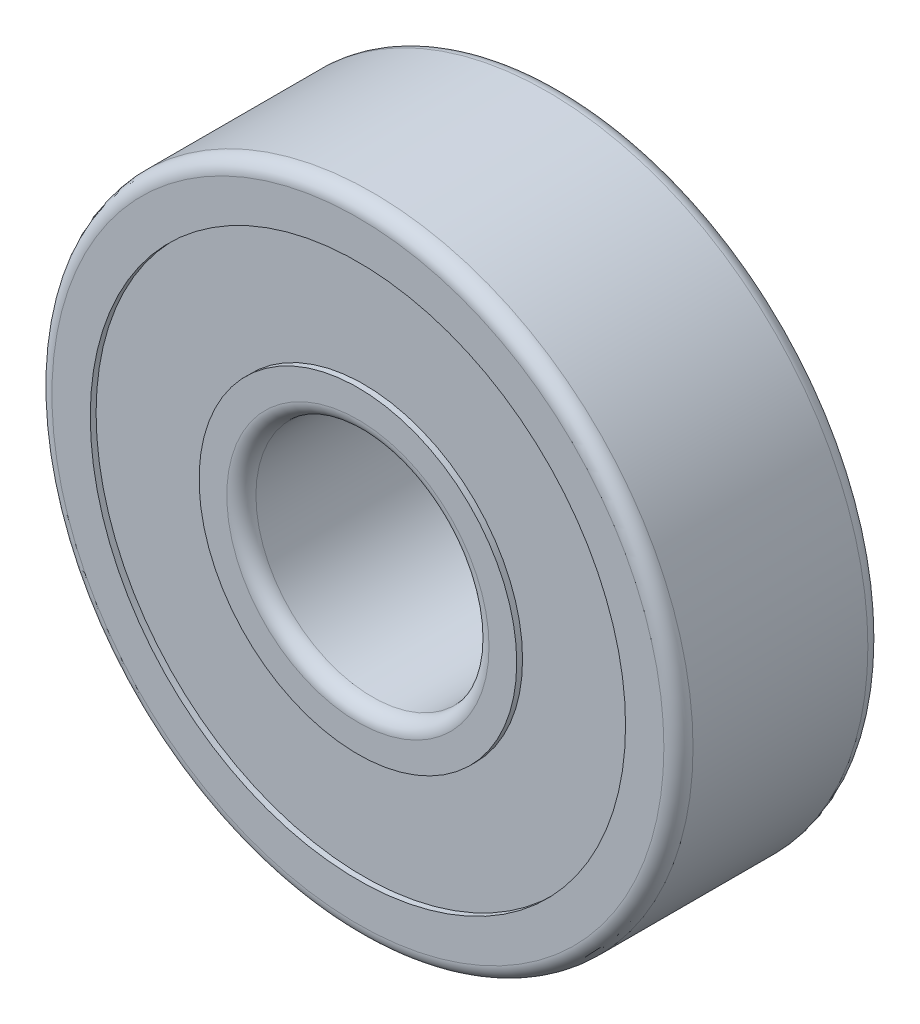
ISO-10303-21;
HEADER;
FILE_DESCRIPTION(('STEP AP214'),'2;1');
FILE_NAME('part.step','',(''),(''),'','','');
FILE_SCHEMA(('AUTOMOTIVE_DESIGN { 1 0 10303 214 1 1 1 1 }'));
ENDSEC;
DATA;
#1=APPLICATION_CONTEXT('core data for automotive mechanical design processes');
#2=APPLICATION_PROTOCOL_DEFINITION('international standard','automotive_design',2000,#1);
#3=PRODUCT_CONTEXT('',#1,'mechanical');
#4=PRODUCT('Part','Part','',(#3));
#5=PRODUCT_RELATED_PRODUCT_CATEGORY('part','',(#4));
#6=PRODUCT_DEFINITION_FORMATION('','',#4);
#7=PRODUCT_DEFINITION_CONTEXT('part definition',#1,'design');
#8=PRODUCT_DEFINITION('design','',#6,#7);
#9=PRODUCT_DEFINITION_SHAPE('','',#8);
#10=(LENGTH_UNIT() NAMED_UNIT(*) SI_UNIT(.MILLI.,.METRE.));
#11=(NAMED_UNIT(*) PLANE_ANGLE_UNIT() SI_UNIT($,.RADIAN.));
#12=(NAMED_UNIT(*) SI_UNIT($,.STERADIAN.) SOLID_ANGLE_UNIT());
#13=UNCERTAINTY_MEASURE_WITH_UNIT(LENGTH_MEASURE(1.E-05),#10,'distance_accuracy_value','');
#14=(GEOMETRIC_REPRESENTATION_CONTEXT(3) GLOBAL_UNCERTAINTY_ASSIGNED_CONTEXT((#13)) GLOBAL_UNIT_ASSIGNED_CONTEXT((#10,
#11,#12)) REPRESENTATION_CONTEXT('',''));
#15=CARTESIAN_POINT('',(0.,0.,0.));
#16=DIRECTION('',(0.,0.,1.));
#17=DIRECTION('',(1.,0.,0.));
#18=AXIS2_PLACEMENT_3D('',#15,#16,#17);
#19=CARTESIAN_POINT('',(0.,0.,-3.5));
#20=DIRECTION('',(0.,0.,1.));
#21=DIRECTION('',(1.,0.,0.));
#22=AXIS2_PLACEMENT_3D('',#19,#20,#21);
#23=PLANE('',#22);
#24=CARTESIAN_POINT('',(0.,0.,-3.5));
#25=DIRECTION('',(0.,0.,1.));
#26=DIRECTION('',(1.,0.,0.));
#27=AXIS2_PLACEMENT_3D('',#24,#25,#26);
#28=CIRCLE('',#27,10.5);
#29=CARTESIAN_POINT('',(10.5,0.,-3.5));
#30=VERTEX_POINT('',#29);
#31=EDGE_CURVE('E41',#30,#30,#28,.F.);
#32=ORIENTED_EDGE('',*,*,#31,.T.);
#33=EDGE_LOOP('',(#32));
#34=FACE_BOUND('',#33,.T.);
#35=CARTESIAN_POINT('',(0.,0.,-3.5));
#36=DIRECTION('',(0.,0.,1.));
#37=DIRECTION('',(1.,0.,0.));
#38=AXIS2_PLACEMENT_3D('',#35,#36,#37);
#39=CIRCLE('',#38,9.18472454375041);
#40=CARTESIAN_POINT('',(9.18472454375041,0.,-3.5));
#41=VERTEX_POINT('',#40);
#42=EDGE_CURVE('E81',#41,#41,#39,.T.);
#43=ORIENTED_EDGE('',*,*,#42,.T.);
#44=EDGE_LOOP('',(#43));
#45=FACE_BOUND('',#44,.T.);
#46=ADVANCED_FACE('F34',(#34,#45),#23,.F.);
#47=CARTESIAN_POINT('',(0.,0.,3.5));
#48=DIRECTION('',(0.,0.,1.));
#49=DIRECTION('',(1.,0.,0.));
#50=AXIS2_PLACEMENT_3D('',#47,#48,#49);
#51=PLANE('',#50);
#52=CARTESIAN_POINT('',(0.,0.,3.5));
#53=DIRECTION('',(0.,0.,1.));
#54=DIRECTION('',(1.,0.,0.));
#55=AXIS2_PLACEMENT_3D('',#52,#53,#54);
#56=CIRCLE('',#55,4.5);
#57=CARTESIAN_POINT('',(4.5,0.,3.5));
#58=VERTEX_POINT('',#57);
#59=EDGE_CURVE('E59',#58,#58,#56,.F.);
#60=ORIENTED_EDGE('',*,*,#59,.T.);
#61=EDGE_LOOP('',(#60));
#62=FACE_BOUND('',#61,.T.);
#63=CARTESIAN_POINT('',(0.,0.,3.5));
#64=DIRECTION('',(0.,0.,1.));
#65=DIRECTION('',(1.,0.,0.));
#66=AXIS2_PLACEMENT_3D('',#63,#64,#65);
#67=CIRCLE('',#66,5.45025485148313);
#68=CARTESIAN_POINT('',(5.45025485148313,0.,3.5));
#69=VERTEX_POINT('',#68);
#70=EDGE_CURVE('E75',#69,#69,#67,.T.);
#71=ORIENTED_EDGE('',*,*,#70,.T.);
#72=EDGE_LOOP('',(#71));
#73=FACE_BOUND('',#72,.T.);
#74=ADVANCED_FACE('F115',(#62,#73),#51,.T.);
#75=CARTESIAN_POINT('',(0.,0.,3.5));
#76=DIRECTION('',(0.,0.,1.));
#77=DIRECTION('',(1.,0.,0.));
#78=AXIS2_PLACEMENT_3D('',#75,#76,#77);
#79=CIRCLE('',#78,10.5);
#80=CARTESIAN_POINT('',(10.5,0.,3.5));
#81=VERTEX_POINT('',#80);
#82=EDGE_CURVE('E56',#81,#81,#79,.T.);
#83=ORIENTED_EDGE('',*,*,#82,.T.);
#84=EDGE_LOOP('',(#83));
#85=FACE_BOUND('',#84,.T.);
#86=CARTESIAN_POINT('',(0.,0.,3.5));
#87=DIRECTION('',(0.,0.,1.));
#88=DIRECTION('',(1.,0.,0.));
#89=AXIS2_PLACEMENT_3D('',#86,#87,#88);
#90=CIRCLE('',#89,9.18472454375041);
#91=CARTESIAN_POINT('',(9.18472454375041,0.,3.5));
#92=VERTEX_POINT('',#91);
#93=EDGE_CURVE('E69',#92,#92,#90,.T.);
#94=ORIENTED_EDGE('',*,*,#93,.F.);
#95=EDGE_LOOP('',(#94));
#96=FACE_BOUND('',#95,.T.);
#97=ADVANCED_FACE('F106',(#85,#96),#51,.T.);
#98=CARTESIAN_POINT('',(0.,0.,-3.5));
#99=DIRECTION('',(0.,0.,1.));
#100=DIRECTION('',(1.,0.,0.));
#101=AXIS2_PLACEMENT_3D('',#98,#99,#100);
#102=CIRCLE('',#101,4.5);
#103=CARTESIAN_POINT('',(4.5,0.,-3.5));
#104=VERTEX_POINT('',#103);
#105=EDGE_CURVE('E10',#104,#104,#102,.T.);
#106=ORIENTED_EDGE('',*,*,#105,.T.);
#107=EDGE_LOOP('',(#106));
#108=FACE_BOUND('',#107,.T.);
#109=CARTESIAN_POINT('',(0.,0.,-3.5));
#110=DIRECTION('',(0.,0.,1.));
#111=DIRECTION('',(1.,0.,0.));
#112=AXIS2_PLACEMENT_3D('',#109,#110,#111);
#113=CIRCLE('',#112,5.45025485148313);
#114=CARTESIAN_POINT('',(5.45025485148313,0.,-3.5));
#115=VERTEX_POINT('',#114);
#116=EDGE_CURVE('E87',#115,#115,#113,.T.);
#117=ORIENTED_EDGE('',*,*,#116,.F.);
#118=EDGE_LOOP('',(#117));
#119=FACE_BOUND('',#118,.T.);
#120=ADVANCED_FACE('F103',(#108,#119),#23,.F.);
#121=CARTESIAN_POINT('',(0.,0.,3.5));
#122=DIRECTION('',(0.,0.,-1.));
#123=DIRECTION('',(-1.,0.,0.));
#124=AXIS2_PLACEMENT_3D('',#121,#122,#123);
#125=CYLINDRICAL_SURFACE('',#124,11.);
#126=CARTESIAN_POINT('',(0.,0.,3.));
#127=DIRECTION('',(0.,0.,1.));
#128=DIRECTION('',(1.,0.,0.));
#129=AXIS2_PLACEMENT_3D('',#126,#127,#128);
#130=CIRCLE('',#129,11.);
#131=CARTESIAN_POINT('',(11.,0.,3.));
#132=VERTEX_POINT('',#131);
#133=EDGE_CURVE('E46',#132,#132,#130,.F.);
#134=ORIENTED_EDGE('',*,*,#133,.T.);
#135=EDGE_LOOP('',(#134));
#136=FACE_BOUND('',#135,.T.);
#137=CARTESIAN_POINT('',(0.,0.,-3.));
#138=DIRECTION('',(0.,0.,1.));
#139=DIRECTION('',(1.,0.,0.));
#140=AXIS2_PLACEMENT_3D('',#137,#138,#139);
#141=CIRCLE('',#140,11.);
#142=CARTESIAN_POINT('',(11.,0.,-3.));
#143=VERTEX_POINT('',#142);
#144=EDGE_CURVE('E51',#143,#143,#141,.T.);
#145=ORIENTED_EDGE('',*,*,#144,.T.);
#146=EDGE_LOOP('',(#145));
#147=FACE_BOUND('',#146,.T.);
#148=ADVANCED_FACE('F105',(#136,#147),#125,.T.);
#149=CARTESIAN_POINT('',(0.,0.,3.5));
#150=DIRECTION('',(0.,0.,-1.));
#151=DIRECTION('',(-1.,0.,0.));
#152=AXIS2_PLACEMENT_3D('',#149,#150,#151);
#153=CYLINDRICAL_SURFACE('',#152,4.);
#154=CARTESIAN_POINT('',(0.,0.,3.));
#155=DIRECTION('',(0.,0.,1.));
#156=DIRECTION('',(1.,0.,0.));
#157=AXIS2_PLACEMENT_3D('',#154,#155,#156);
#158=CIRCLE('',#157,4.);
#159=CARTESIAN_POINT('',(4.,0.,3.));
#160=VERTEX_POINT('',#159);
#161=EDGE_CURVE('E62',#160,#160,#158,.T.);
#162=ORIENTED_EDGE('',*,*,#161,.T.);
#163=EDGE_LOOP('',(#162));
#164=FACE_BOUND('',#163,.T.);
#165=CARTESIAN_POINT('',(0.,0.,-3.));
#166=DIRECTION('',(0.,0.,1.));
#167=DIRECTION('',(1.,0.,0.));
#168=AXIS2_PLACEMENT_3D('',#165,#166,#167);
#169=CIRCLE('',#168,4.);
#170=CARTESIAN_POINT('',(4.,0.,-3.));
#171=VERTEX_POINT('',#170);
#172=EDGE_CURVE('E65',#171,#171,#169,.F.);
#173=ORIENTED_EDGE('',*,*,#172,.T.);
#174=EDGE_LOOP('',(#173));
#175=FACE_BOUND('',#174,.T.);
#176=ADVANCED_FACE('F112',(#164,#175),#153,.F.);
#177=CARTESIAN_POINT('',(0.,0.,3.3));
#178=DIRECTION('',(0.,0.,1.));
#179=DIRECTION('',(1.,0.,0.));
#180=AXIS2_PLACEMENT_3D('',#177,#178,#179);
#181=CYLINDRICAL_SURFACE('',#180,9.18472454375041);
#182=CARTESIAN_POINT('',(0.,0.,3.3));
#183=DIRECTION('',(0.,0.,1.));
#184=DIRECTION('',(1.,0.,0.));
#185=AXIS2_PLACEMENT_3D('',#182,#183,#184);
#186=CIRCLE('',#185,9.18472454375041);
#187=CARTESIAN_POINT('',(9.18472454375041,0.,3.3));
#188=VERTEX_POINT('',#187);
#189=EDGE_CURVE('E68',#188,#188,#186,.T.);
#190=ORIENTED_EDGE('',*,*,#189,.F.);
#191=EDGE_LOOP('',(#190));
#192=FACE_BOUND('',#191,.T.);
#193=ORIENTED_EDGE('',*,*,#93,.T.);
#194=EDGE_LOOP('',(#193));
#195=FACE_BOUND('',#194,.T.);
#196=ADVANCED_FACE('F142',(#192,#195),#181,.F.);
#197=CARTESIAN_POINT('',(0.,0.,3.3));
#198=DIRECTION('',(0.,0.,1.));
#199=DIRECTION('',(1.,0.,0.));
#200=AXIS2_PLACEMENT_3D('',#197,#198,#199);
#201=PLANE('',#200);
#202=CARTESIAN_POINT('',(0.,0.,3.3));
#203=DIRECTION('',(0.,0.,1.));
#204=DIRECTION('',(1.,0.,0.));
#205=AXIS2_PLACEMENT_3D('',#202,#203,#204);
#206=CIRCLE('',#205,5.45025485148313);
#207=CARTESIAN_POINT('',(5.45025485148313,0.,3.3));
#208=VERTEX_POINT('',#207);
#209=EDGE_CURVE('E72',#208,#208,#206,.T.);
#210=ORIENTED_EDGE('',*,*,#209,.F.);
#211=EDGE_LOOP('',(#210));
#212=FACE_BOUND('',#211,.T.);
#213=ORIENTED_EDGE('',*,*,#189,.T.);
#214=EDGE_LOOP('',(#213));
#215=FACE_BOUND('',#214,.T.);
#216=ADVANCED_FACE('F138',(#212,#215),#201,.T.);
#217=CARTESIAN_POINT('',(0.,0.,3.3));
#218=DIRECTION('',(0.,0.,1.));
#219=DIRECTION('',(1.,0.,0.));
#220=AXIS2_PLACEMENT_3D('',#217,#218,#219);
#221=CYLINDRICAL_SURFACE('',#220,5.45025485148313);
#222=ORIENTED_EDGE('',*,*,#209,.T.);
#223=EDGE_LOOP('',(#222));
#224=FACE_BOUND('',#223,.T.);
#225=ORIENTED_EDGE('',*,*,#70,.F.);
#226=EDGE_LOOP('',(#225));
#227=FACE_BOUND('',#226,.T.);
#228=ADVANCED_FACE('F132',(#224,#227),#221,.T.);
#229=CARTESIAN_POINT('',(0.,0.,-3.3));
#230=DIRECTION('',(0.,0.,-1.));
#231=DIRECTION('',(1.,0.,0.));
#232=AXIS2_PLACEMENT_3D('',#229,#230,#231);
#233=PLANE('',#232);
#234=CARTESIAN_POINT('',(0.,0.,-3.3));
#235=DIRECTION('',(0.,0.,1.));
#236=DIRECTION('',(1.,0.,0.));
#237=AXIS2_PLACEMENT_3D('',#234,#235,#236);
#238=CIRCLE('',#237,9.18472454375041);
#239=CARTESIAN_POINT('',(9.18472454375041,0.,-3.3));
#240=VERTEX_POINT('',#239);
#241=EDGE_CURVE('E78',#240,#240,#238,.T.);
#242=ORIENTED_EDGE('',*,*,#241,.F.);
#243=EDGE_LOOP('',(#242));
#244=FACE_BOUND('',#243,.T.);
#245=CARTESIAN_POINT('',(0.,0.,-3.3));
#246=DIRECTION('',(0.,0.,1.));
#247=DIRECTION('',(1.,0.,0.));
#248=AXIS2_PLACEMENT_3D('',#245,#246,#247);
#249=CIRCLE('',#248,5.45025485148313);
#250=CARTESIAN_POINT('',(5.45025485148313,0.,-3.3));
#251=VERTEX_POINT('',#250);
#252=EDGE_CURVE('E84',#251,#251,#249,.T.);
#253=ORIENTED_EDGE('',*,*,#252,.T.);
#254=EDGE_LOOP('',(#253));
#255=FACE_BOUND('',#254,.T.);
#256=ADVANCED_FACE('F93',(#244,#255),#233,.T.);
#257=CARTESIAN_POINT('',(0.,0.,-3.3));
#258=DIRECTION('',(0.,0.,-1.));
#259=DIRECTION('',(-1.,0.,0.));
#260=AXIS2_PLACEMENT_3D('',#257,#258,#259);
#261=CYLINDRICAL_SURFACE('',#260,9.18472454375041);
#262=ORIENTED_EDGE('',*,*,#241,.T.);
#263=EDGE_LOOP('',(#262));
#264=FACE_BOUND('',#263,.T.);
#265=ORIENTED_EDGE('',*,*,#42,.F.);
#266=EDGE_LOOP('',(#265));
#267=FACE_BOUND('',#266,.T.);
#268=ADVANCED_FACE('F99',(#264,#267),#261,.F.);
#269=CARTESIAN_POINT('',(0.,0.,-3.3));
#270=DIRECTION('',(0.,0.,-1.));
#271=DIRECTION('',(-1.,0.,0.));
#272=AXIS2_PLACEMENT_3D('',#269,#270,#271);
#273=CYLINDRICAL_SURFACE('',#272,5.45025485148313);
#274=ORIENTED_EDGE('',*,*,#252,.F.);
#275=EDGE_LOOP('',(#274));
#276=FACE_BOUND('',#275,.T.);
#277=ORIENTED_EDGE('',*,*,#116,.T.);
#278=EDGE_LOOP('',(#277));
#279=FACE_BOUND('',#278,.T.);
#280=ADVANCED_FACE('F95',(#276,#279),#273,.T.);
#281=CARTESIAN_POINT('',(0.,0.,3.));
#282=DIRECTION('',(0.,0.,1.));
#283=DIRECTION('',(1.,0.,0.));
#284=AXIS2_PLACEMENT_3D('',#281,#282,#283);
#285=TOROIDAL_SURFACE('',#284,4.5,0.5);
#286=ORIENTED_EDGE('',*,*,#59,.F.);
#287=EDGE_LOOP('',(#286));
#288=FACE_BOUND('',#287,.T.);
#289=ORIENTED_EDGE('',*,*,#161,.F.);
#290=EDGE_LOOP('',(#289));
#291=FACE_BOUND('',#290,.T.);
#292=ADVANCED_FACE('F98',(#288,#291),#285,.T.);
#293=CARTESIAN_POINT('',(0.,0.,3.));
#294=DIRECTION('',(0.,0.,1.));
#295=DIRECTION('',(1.,0.,0.));
#296=AXIS2_PLACEMENT_3D('',#293,#294,#295);
#297=TOROIDAL_SURFACE('',#296,10.5,0.5);
#298=ORIENTED_EDGE('',*,*,#133,.F.);
#299=EDGE_LOOP('',(#298));
#300=FACE_BOUND('',#299,.T.);
#301=ORIENTED_EDGE('',*,*,#82,.F.);
#302=EDGE_LOOP('',(#301));
#303=FACE_BOUND('',#302,.T.);
#304=ADVANCED_FACE('F161',(#300,#303),#297,.T.);
#305=CARTESIAN_POINT('',(0.,0.,-3.));
#306=DIRECTION('',(0.,0.,1.));
#307=DIRECTION('',(1.,0.,0.));
#308=AXIS2_PLACEMENT_3D('',#305,#306,#307);
#309=TOROIDAL_SURFACE('',#308,10.5,0.5);
#310=ORIENTED_EDGE('',*,*,#31,.F.);
#311=EDGE_LOOP('',(#310));
#312=FACE_BOUND('',#311,.T.);
#313=ORIENTED_EDGE('',*,*,#144,.F.);
#314=EDGE_LOOP('',(#313));
#315=FACE_BOUND('',#314,.T.);
#316=ADVANCED_FACE('F157',(#312,#315),#309,.T.);
#317=CARTESIAN_POINT('',(0.,0.,-3.));
#318=DIRECTION('',(0.,0.,1.));
#319=DIRECTION('',(1.,0.,0.));
#320=AXIS2_PLACEMENT_3D('',#317,#318,#319);
#321=TOROIDAL_SURFACE('',#320,4.5,0.5);
#322=ORIENTED_EDGE('',*,*,#172,.F.);
#323=EDGE_LOOP('',(#322));
#324=FACE_BOUND('',#323,.T.);
#325=ORIENTED_EDGE('',*,*,#105,.F.);
#326=EDGE_LOOP('',(#325));
#327=FACE_BOUND('',#326,.T.);
#328=ADVANCED_FACE('F36',(#324,#327),#321,.T.);
#329=CLOSED_SHELL('',(#46,#74,#97,#120,#148,#176,#196,#216,#228,#256,#268,#280,#292,#304,#316,#328));
#330=MANIFOLD_SOLID_BREP('B2',#329);
#331=ADVANCED_BREP_SHAPE_REPRESENTATION('',(#18,#330),#14);
#332=SHAPE_DEFINITION_REPRESENTATION(#9,#331);
ENDSEC;
END-ISO-10303-21;
